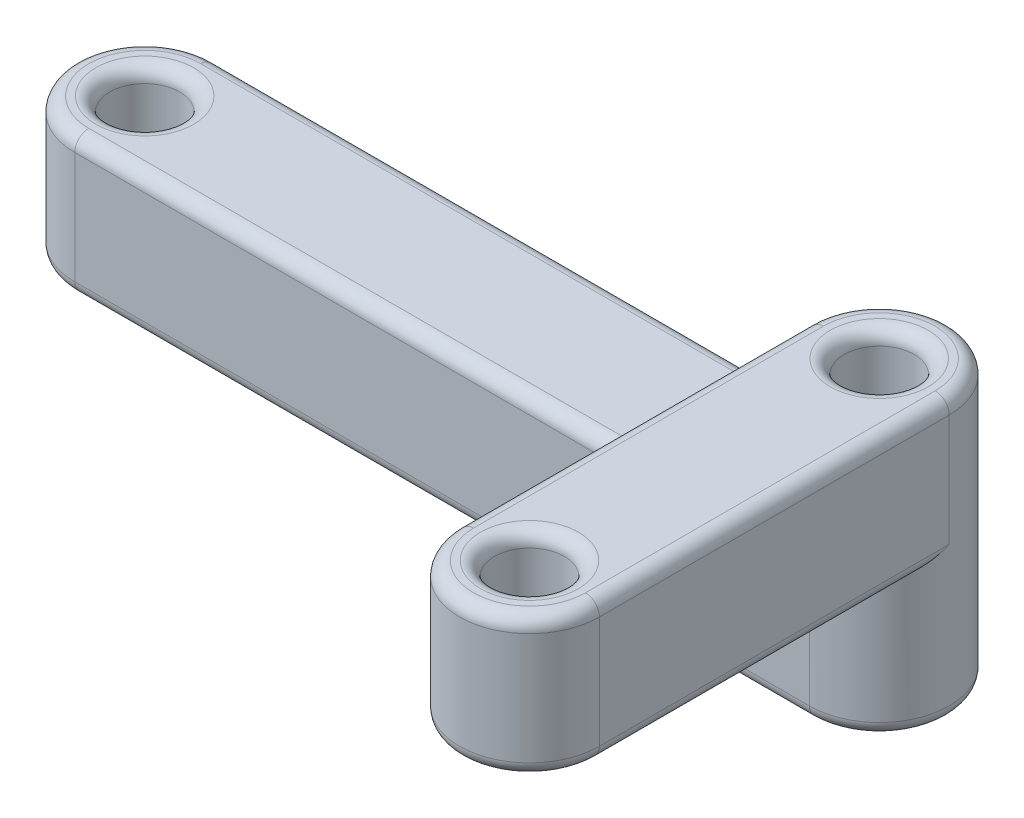
ISO-10303-21;
HEADER;
FILE_DESCRIPTION(('STEP AP214'),'2;1');
FILE_NAME('part.step','',(''),(''),'','','');
FILE_SCHEMA(('AUTOMOTIVE_DESIGN { 1 0 10303 214 1 1 1 1 }'));
ENDSEC;
DATA;
#1=APPLICATION_CONTEXT('core data for automotive mechanical design processes');
#2=APPLICATION_PROTOCOL_DEFINITION('international standard','automotive_design',2000,#1);
#3=PRODUCT_CONTEXT('',#1,'mechanical');
#4=PRODUCT('Part','Part','',(#3));
#5=PRODUCT_RELATED_PRODUCT_CATEGORY('part','',(#4));
#6=PRODUCT_DEFINITION_FORMATION('','',#4);
#7=PRODUCT_DEFINITION_CONTEXT('part definition',#1,'design');
#8=PRODUCT_DEFINITION('design','',#6,#7);
#9=PRODUCT_DEFINITION_SHAPE('','',#8);
#10=(LENGTH_UNIT() NAMED_UNIT(*) SI_UNIT(.MILLI.,.METRE.));
#11=(NAMED_UNIT(*) PLANE_ANGLE_UNIT() SI_UNIT($,.RADIAN.));
#12=(NAMED_UNIT(*) SI_UNIT($,.STERADIAN.) SOLID_ANGLE_UNIT());
#13=UNCERTAINTY_MEASURE_WITH_UNIT(LENGTH_MEASURE(1.E-05),#10,'distance_accuracy_value','');
#14=(GEOMETRIC_REPRESENTATION_CONTEXT(3) GLOBAL_UNCERTAINTY_ASSIGNED_CONTEXT((#13)) GLOBAL_UNIT_ASSIGNED_CONTEXT((#10,
#11,#12)) REPRESENTATION_CONTEXT('',''));
#15=CARTESIAN_POINT('',(0.,0.,0.));
#16=DIRECTION('',(0.,0.,1.));
#17=DIRECTION('',(1.,0.,0.));
#18=AXIS2_PLACEMENT_3D('',#15,#16,#17);
#19=CARTESIAN_POINT('',(0.,10.,0.));
#20=DIRECTION('',(0.,1.,0.));
#21=DIRECTION('',(0.,0.,1.));
#22=AXIS2_PLACEMENT_3D('',#19,#20,#21);
#23=PLANE('',#22);
#24=CARTESIAN_POINT('',(0.,10.,0.));
#25=DIRECTION('',(0.,1.,0.));
#26=DIRECTION('',(0.,0.,1.));
#27=AXIS2_PLACEMENT_3D('',#24,#25,#26);
#28=CIRCLE('',#27,3.5);
#29=CARTESIAN_POINT('',(0.,10.,3.5));
#30=VERTEX_POINT('',#29);
#31=EDGE_CURVE('E182',#30,#30,#28,.F.);
#32=ORIENTED_EDGE('',*,*,#31,.T.);
#33=EDGE_LOOP('',(#32));
#34=FACE_BOUND('',#33,.T.);
#35=CARTESIAN_POINT('',(52.5,10.,0.));
#36=DIRECTION('',(0.,1.,0.));
#37=DIRECTION('',(0.,0.,1.));
#38=AXIS2_PLACEMENT_3D('',#35,#36,#37);
#39=CIRCLE('',#38,5.);
#40=CARTESIAN_POINT('',(49.5,10.,-4.));
#41=VERTEX_POINT('',#40);
#42=CARTESIAN_POINT('',(48.4999976821951,10.,2.99999690959103));
#43=VERTEX_POINT('',#42);
#44=EDGE_CURVE('E56',#41,#43,#39,.T.);
#45=ORIENTED_EDGE('',*,*,#44,.F.);
#46=DIRECTION('',(-1.,0.,0.));
#47=VECTOR('',#46,1.);
#48=CARTESIAN_POINT('',(0.,10.,-4.));
#49=LINE('',#48,#47);
#50=CARTESIAN_POINT('',(0.,10.,-4.));
#51=VERTEX_POINT('',#50);
#52=EDGE_CURVE('E169',#41,#51,#49,.T.);
#53=ORIENTED_EDGE('',*,*,#52,.T.);
#54=CARTESIAN_POINT('',(0.,10.,0.));
#55=DIRECTION('',(0.,1.,0.));
#56=DIRECTION('',(0.,0.,1.));
#57=AXIS2_PLACEMENT_3D('',#54,#55,#56);
#58=CIRCLE('',#57,4.);
#59=CARTESIAN_POINT('',(0.,10.,4.));
#60=VERTEX_POINT('',#59);
#61=EDGE_CURVE('E183',#51,#60,#58,.T.);
#62=ORIENTED_EDGE('',*,*,#61,.T.);
#63=DIRECTION('',(1.,0.,0.));
#64=VECTOR('',#63,1.);
#65=CARTESIAN_POINT('',(47.5,10.,4.));
#66=LINE('',#65,#64);
#67=CARTESIAN_POINT('',(48.5,10.,4.0000029962598));
#68=VERTEX_POINT('',#67);
#69=EDGE_CURVE('E174',#60,#68,#66,.T.);
#70=ORIENTED_EDGE('',*,*,#69,.T.);
#71=DIRECTION('',(0.,0.,1.));
#72=VECTOR('',#71,1.);
#73=CARTESIAN_POINT('',(48.5,10.,3.49999845479596));
#74=LINE('',#73,#72);
#75=EDGE_CURVE('E49',#68,#43,#74,.F.);
#76=ORIENTED_EDGE('',*,*,#75,.T.);
#77=EDGE_LOOP('',(#45,#53,#62,#70,#76));
#78=FACE_BOUND('',#77,.T.);
#79=ADVANCED_FACE('F39',(#34,#78),#23,.T.);
#80=CARTESIAN_POINT('',(0.,0.,0.));
#81=DIRECTION('',(0.,1.,0.));
#82=DIRECTION('',(0.,0.,1.));
#83=AXIS2_PLACEMENT_3D('',#80,#81,#82);
#84=PLANE('',#83);
#85=CARTESIAN_POINT('',(52.5,0.,0.));
#86=DIRECTION('',(0.,1.,0.));
#87=DIRECTION('',(0.,0.,1.));
#88=AXIS2_PLACEMENT_3D('',#85,#86,#87);
#89=CIRCLE('',#88,3.5);
#90=CARTESIAN_POINT('',(52.5,0.,3.5));
#91=VERTEX_POINT('',#90);
#92=EDGE_CURVE('E296',#91,#91,#89,.T.);
#93=ORIENTED_EDGE('',*,*,#92,.T.);
#94=EDGE_LOOP('',(#93));
#95=FACE_BOUND('',#94,.T.);
#96=CARTESIAN_POINT('',(0.,0.,0.));
#97=DIRECTION('',(0.,1.,0.));
#98=DIRECTION('',(0.,0.,1.));
#99=AXIS2_PLACEMENT_3D('',#96,#97,#98);
#100=CIRCLE('',#99,3.5);
#101=CARTESIAN_POINT('',(0.,0.,3.5));
#102=VERTEX_POINT('',#101);
#103=EDGE_CURVE('E292',#102,#102,#100,.T.);
#104=ORIENTED_EDGE('',*,*,#103,.T.);
#105=EDGE_LOOP('',(#104));
#106=FACE_BOUND('',#105,.T.);
#107=CARTESIAN_POINT('',(52.5,0.,0.));
#108=DIRECTION('',(0.,1.,0.));
#109=DIRECTION('',(0.,0.,1.));
#110=AXIS2_PLACEMENT_3D('',#107,#108,#109);
#111=CIRCLE('',#110,4.);
#112=CARTESIAN_POINT('',(52.5,0.,-4.));
#113=VERTEX_POINT('',#112);
#114=CARTESIAN_POINT('',(52.5,0.,4.));
#115=VERTEX_POINT('',#114);
#116=EDGE_CURVE('E285',#113,#115,#111,.F.);
#117=ORIENTED_EDGE('',*,*,#116,.T.);
#118=DIRECTION('',(1.,0.,0.));
#119=VECTOR('',#118,1.);
#120=CARTESIAN_POINT('',(0.,0.,4.));
#121=LINE('',#120,#119);
#122=CARTESIAN_POINT('',(0.,0.,4.));
#123=VERTEX_POINT('',#122);
#124=EDGE_CURVE('E288',#115,#123,#121,.F.);
#125=ORIENTED_EDGE('',*,*,#124,.T.);
#126=CARTESIAN_POINT('',(0.,0.,0.));
#127=DIRECTION('',(0.,1.,0.));
#128=DIRECTION('',(0.,0.,1.));
#129=AXIS2_PLACEMENT_3D('',#126,#127,#128);
#130=CIRCLE('',#129,4.);
#131=CARTESIAN_POINT('',(0.,0.,-4.));
#132=VERTEX_POINT('',#131);
#133=EDGE_CURVE('E279',#123,#132,#130,.F.);
#134=ORIENTED_EDGE('',*,*,#133,.T.);
#135=DIRECTION('',(-1.,0.,0.));
#136=VECTOR('',#135,1.);
#137=CARTESIAN_POINT('',(0.,0.,-4.));
#138=LINE('',#137,#136);
#139=EDGE_CURVE('E282',#132,#113,#138,.F.);
#140=ORIENTED_EDGE('',*,*,#139,.T.);
#141=EDGE_LOOP('',(#117,#125,#134,#140));
#142=FACE_BOUND('',#141,.T.);
#143=ADVANCED_FACE('F420',(#95,#106,#142),#84,.F.);
#144=CARTESIAN_POINT('',(0.,10.,0.));
#145=DIRECTION('',(0.,-1.,0.));
#146=DIRECTION('',(0.,0.,-1.));
#147=AXIS2_PLACEMENT_3D('',#144,#145,#146);
#148=CYLINDRICAL_SURFACE('',#147,5.);
#149=DIRECTION('',(0.,-1.,0.));
#150=VECTOR('',#149,1.);
#151=CARTESIAN_POINT('',(0.,10.,5.));
#152=LINE('',#151,#150);
#153=CARTESIAN_POINT('',(0.,9.,5.));
#154=VERTEX_POINT('',#153);
#155=CARTESIAN_POINT('',(0.,0.999999999999999,5.));
#156=VERTEX_POINT('',#155);
#157=EDGE_CURVE('E175',#154,#156,#152,.T.);
#158=ORIENTED_EDGE('',*,*,#157,.F.);
#159=CARTESIAN_POINT('',(0.,9.,0.));
#160=DIRECTION('',(0.,1.,0.));
#161=DIRECTION('',(0.,0.,1.));
#162=AXIS2_PLACEMENT_3D('',#159,#160,#161);
#163=CIRCLE('',#162,5.);
#164=CARTESIAN_POINT('',(0.,9.,-5.));
#165=VERTEX_POINT('',#164);
#166=EDGE_CURVE('E201',#154,#165,#163,.F.);
#167=ORIENTED_EDGE('',*,*,#166,.T.);
#168=DIRECTION('',(0.,-1.,0.));
#169=VECTOR('',#168,1.);
#170=CARTESIAN_POINT('',(0.,10.,-5.));
#171=LINE('',#170,#169);
#172=CARTESIAN_POINT('',(0.,0.999999999999999,-5.));
#173=VERTEX_POINT('',#172);
#174=EDGE_CURVE('E440',#165,#173,#171,.T.);
#175=ORIENTED_EDGE('',*,*,#174,.T.);
#176=CARTESIAN_POINT('',(0.,0.999999999999999,0.));
#177=DIRECTION('',(0.,1.,0.));
#178=DIRECTION('',(0.,0.,1.));
#179=AXIS2_PLACEMENT_3D('',#176,#177,#178);
#180=CIRCLE('',#179,5.);
#181=EDGE_CURVE('E198',#173,#156,#180,.T.);
#182=ORIENTED_EDGE('',*,*,#181,.T.);
#183=EDGE_LOOP('',(#158,#167,#175,#182));
#184=FACE_BOUND('',#183,.T.);
#185=ADVANCED_FACE('F493',(#184),#148,.T.);
#186=CARTESIAN_POINT('',(0.,10.,5.));
#187=DIRECTION('',(0.,0.,-1.));
#188=DIRECTION('',(-1.,0.,0.));
#189=AXIS2_PLACEMENT_3D('',#186,#187,#188);
#190=PLANE('',#189);
#191=ORIENTED_EDGE('',*,*,#157,.T.);
#192=DIRECTION('',(1.,0.,0.));
#193=VECTOR('',#192,1.);
#194=CARTESIAN_POINT('',(0.,0.999999999999999,5.));
#195=LINE('',#194,#193);
#196=CARTESIAN_POINT('',(52.5,0.999999999999999,5.));
#197=VERTEX_POINT('',#196);
#198=EDGE_CURVE('E165',#156,#197,#195,.T.);
#199=ORIENTED_EDGE('',*,*,#198,.T.);
#200=DIRECTION('',(0.,-1.,0.));
#201=VECTOR('',#200,1.);
#202=CARTESIAN_POINT('',(52.5,10.,5.));
#203=LINE('',#202,#201);
#204=CARTESIAN_POINT('',(52.5,9.,5.));
#205=VERTEX_POINT('',#204);
#206=EDGE_CURVE('E431',#205,#197,#203,.T.);
#207=ORIENTED_EDGE('',*,*,#206,.F.);
#208=DIRECTION('',(1.,0.,0.));
#209=VECTOR('',#208,1.);
#210=CARTESIAN_POINT('',(0.,9.,5.));
#211=LINE('',#210,#209);
#212=EDGE_CURVE('E308',#205,#154,#211,.F.);
#213=ORIENTED_EDGE('',*,*,#212,.T.);
#214=EDGE_LOOP('',(#191,#199,#207,#213));
#215=FACE_BOUND('',#214,.T.);
#216=ADVANCED_FACE('F334',(#215),#190,.F.);
#217=CARTESIAN_POINT('',(52.5,10.,0.));
#218=DIRECTION('',(0.,-1.,0.));
#219=DIRECTION('',(0.,0.,-1.));
#220=AXIS2_PLACEMENT_3D('',#217,#218,#219);
#221=CYLINDRICAL_SURFACE('',#220,5.);
#222=DIRECTION('',(0.,-1.,0.));
#223=VECTOR('',#222,1.);
#224=CARTESIAN_POINT('',(47.5,20.,0.));
#225=LINE('',#224,#223);
#226=CARTESIAN_POINT('',(47.5,19.,0.));
#227=VERTEX_POINT('',#226);
#228=CARTESIAN_POINT('',(47.5,11.,0.));
#229=VERTEX_POINT('',#228);
#230=EDGE_CURVE('E462',#227,#229,#225,.T.);
#231=ORIENTED_EDGE('',*,*,#230,.F.);
#232=CARTESIAN_POINT('',(52.5,19.,0.));
#233=DIRECTION('',(0.,1.,0.));
#234=DIRECTION('',(0.,0.,1.));
#235=AXIS2_PLACEMENT_3D('',#232,#233,#234);
#236=CIRCLE('',#235,5.);
#237=CARTESIAN_POINT('',(57.5,19.,0.));
#238=VERTEX_POINT('',#237);
#239=EDGE_CURVE('E268',#227,#238,#236,.F.);
#240=ORIENTED_EDGE('',*,*,#239,.T.);
#241=DIRECTION('',(0.,-1.,0.));
#242=VECTOR('',#241,1.);
#243=CARTESIAN_POINT('',(57.5,20.,0.));
#244=LINE('',#243,#242);
#245=CARTESIAN_POINT('',(57.5,11.,0.));
#246=VERTEX_POINT('',#245);
#247=EDGE_CURVE('E381',#238,#246,#244,.T.);
#248=ORIENTED_EDGE('',*,*,#247,.T.);
#249=CARTESIAN_POINT('',(56.5,10.,3.));
#250=CARTESIAN_POINT('',(56.5473045609069,10.0000371623371,2.93694469530654));
#251=CARTESIAN_POINT('',(56.5930515988321,10.0033524811115,2.87282528320766));
#252=CARTESIAN_POINT('',(56.6811677355867,10.0155357840315,2.74298227571179));
#253=CARTESIAN_POINT('',(56.7235430910172,10.0243931997809,2.67726196184714));
#254=CARTESIAN_POINT('',(56.8045590614737,10.0465893681849,2.54494770540636));
#255=CARTESIAN_POINT('',(56.843223014705,10.0598973817613,2.47836268732835));
#256=CARTESIAN_POINT('',(56.9171260446218,10.0902730823418,2.34411430702213));
#257=CARTESIAN_POINT('',(56.9523628486697,10.1073432399562,2.27645026340865));
#258=CARTESIAN_POINT('',(57.040738852702,10.1564689465733,2.09692992286534));
#259=CARTESIAN_POINT('',(57.0909944731759,10.1911463028468,1.98436263846201));
#260=CARTESIAN_POINT('',(57.1824784458445,10.2666906947068,1.75765553787566));
#261=CARTESIAN_POINT('',(57.2237029602559,10.3075603492893,1.64351507498279));
#262=CARTESIAN_POINT('',(57.2975084908041,10.3940114614077,1.41369488013739));
#263=CARTESIAN_POINT('',(57.3300552903853,10.4396106144798,1.29801088982785));
#264=CARTESIAN_POINT('',(57.3865178315478,10.5340479617569,1.0659279349572));
#265=CARTESIAN_POINT('',(57.4104363503651,10.5828851077276,0.949529212741659));
#266=CARTESIAN_POINT('',(57.4531791346661,10.691153566795,0.69652380572792));
#267=CARTESIAN_POINT('',(57.4704595596891,10.7509805574236,0.559826112249049));
#268=CARTESIAN_POINT('',(57.4936734801876,10.8719499211339,0.286372958720131));
#269=CARTESIAN_POINT('',(57.4996304485303,10.9330893068729,0.149618207237307));
#270=CARTESIAN_POINT('',(57.4999944415562,10.9961510185399,0.00860658611443853));
#271=CARTESIAN_POINT('',(57.4999999967752,10.9980755215741,0.00430326664155501));
#272=CARTESIAN_POINT('',(57.5,11.,0.));
#273=B_SPLINE_CURVE_WITH_KNOTS('',3,(#249,#250,#251,#252,#253,#254,#255,#256,#257,#258,#259,
#260,#261,#262,#263,#264,#265,#266,#267,#268,#269,#270,#271,#272),.UNSPECIFIED.,.F.,.F.,(4,2,2,
2,2,2,2,2,2,2,2,4),(0.,0.236272200850865,0.472095214354163,0.706321989677946,0.940703043144717,
1.32429275355729,1.70804515619849,2.09328905143225,2.4784088350463,2.92860728181174,
3.37787147131306,3.39201361675778),.UNSPECIFIED.);
#274=CARTESIAN_POINT('',(56.5,10.,3.));
#275=VERTEX_POINT('',#274);
#276=EDGE_CURVE('E164',#246,#275,#273,.F.);
#277=ORIENTED_EDGE('',*,*,#276,.T.);
#278=CARTESIAN_POINT('',(52.5,10.,0.));
#279=DIRECTION('',(0.,1.,0.));
#280=DIRECTION('',(0.,0.,1.));
#281=AXIS2_PLACEMENT_3D('',#278,#279,#280);
#282=CIRCLE('',#281,5.);
#283=CARTESIAN_POINT('',(49.500003090395,10.,4.00000231779438));
#284=VERTEX_POINT('',#283);
#285=EDGE_CURVE('E63',#284,#275,#282,.T.);
#286=ORIENTED_EDGE('',*,*,#285,.F.);
#287=CARTESIAN_POINT('',(49.5000030903941,10.,4.00000231779557));
#288=CARTESIAN_POINT('',(49.5630585639918,9.99996272788554,4.0473069292137));
#289=CARTESIAN_POINT('',(49.627178144695,9.99664729604782,4.09305400780324));
#290=CARTESIAN_POINT('',(49.7570214883626,9.98446376315244,4.18117020788826));
#291=CARTESIAN_POINT('',(49.822741969799,9.97560623048925,4.22354558601357));
#292=CARTESIAN_POINT('',(49.9550565615217,9.95340982711111,4.30456158689411));
#293=CARTESIAN_POINT('',(50.0216417473626,9.94010169532688,4.34322554784478));
#294=CARTESIAN_POINT('',(50.1558904622435,9.90972575797051,4.4171285781539));
#295=CARTESIAN_POINT('',(50.2235546726675,9.89265548178963,4.45236537486656));
#296=CARTESIAN_POINT('',(50.4030754431162,9.8435294660715,4.54074133686772));
#297=CARTESIAN_POINT('',(50.515642989588,9.80885192064983,4.59099691159405));
#298=CARTESIAN_POINT('',(50.7423506113859,9.73330715742923,4.68248075978109));
#299=CARTESIAN_POINT('',(50.8564913334213,9.69243732063438,4.72370519544018));
#300=CARTESIAN_POINT('',(51.0863120402139,9.60598585454873,4.7975105354013));
#301=CARTESIAN_POINT('',(51.2019962832758,9.56038652992614,4.83005722334842));
#302=CARTESIAN_POINT('',(51.4340797400968,9.4659488520361,4.88651951097145));
#303=CARTESIAN_POINT('',(51.5504787115088,9.41711154701025,4.91043788792276));
#304=CARTESIAN_POINT('',(51.8034830148737,9.3088434609588,4.95318005443348));
#305=CARTESIAN_POINT('',(51.9401793465249,9.2490170406606,4.97046013632466));
#306=CARTESIAN_POINT('',(52.213629772101,9.12804885797665,4.99367359904575));
#307=CARTESIAN_POINT('',(52.3503831574857,9.06691008281707,4.9996304520507));
#308=CARTESIAN_POINT('',(52.4913934138853,9.00384898146071,4.9999944415563));
#309=CARTESIAN_POINT('',(52.4956967333581,9.00192447842627,4.99999999677532));
#310=CARTESIAN_POINT('',(52.5,9.,5.));
#311=B_SPLINE_CURVE_WITH_KNOTS('',3,(#287,#288,#289,#290,#291,#292,#293,#294,#295,#296,#297,
#298,#299,#300,#301,#302,#303,#304,#305,#306,#307,#308,#309,#310),.UNSPECIFIED.,.F.,.F.,(4,2,2,
2,2,2,2,2,2,2,2,4),(0.,0.236272696950567,0.472096206008266,0.706323481753092,0.940705035857717,
1.32429553611635,1.70804872912376,2.09329340374744,2.47841396517604,2.92860790899919,
3.37786761366824,3.39200975911296),.UNSPECIFIED.);
#312=EDGE_CURVE('E340',#284,#205,#311,.T.);
#313=ORIENTED_EDGE('',*,*,#312,.T.);
#314=ORIENTED_EDGE('',*,*,#206,.T.);
#315=CARTESIAN_POINT('',(52.5,0.999999999999999,0.));
#316=DIRECTION('',(0.,1.,0.));
#317=DIRECTION('',(0.,0.,1.));
#318=AXIS2_PLACEMENT_3D('',#315,#316,#317);
#319=CIRCLE('',#318,5.);
#320=CARTESIAN_POINT('',(52.5,0.999999999999999,-5.));
#321=VERTEX_POINT('',#320);
#322=EDGE_CURVE('E265',#197,#321,#319,.T.);
#323=ORIENTED_EDGE('',*,*,#322,.T.);
#324=DIRECTION('',(0.,-1.,0.));
#325=VECTOR('',#324,1.);
#326=CARTESIAN_POINT('',(52.5,10.,-5.));
#327=LINE('',#326,#325);
#328=CARTESIAN_POINT('',(52.5,9.,-5.));
#329=VERTEX_POINT('',#328);
#330=EDGE_CURVE('E159',#329,#321,#327,.T.);
#331=ORIENTED_EDGE('',*,*,#330,.F.);
#332=CARTESIAN_POINT('',(49.5,10.,-4.));
#333=CARTESIAN_POINT('',(49.5630553046935,9.99996283766288,-4.04730456090694));
#334=CARTESIAN_POINT('',(49.6271747167924,9.99664751888849,-4.09305159883218));
#335=CARTESIAN_POINT('',(49.7570177242884,9.9844642159685,-4.18116773558682));
#336=CARTESIAN_POINT('',(49.8227380381531,9.97560680021902,-4.22354309101737));
#337=CARTESIAN_POINT('',(49.9550522945939,9.95341063181508,-4.30455906147386));
#338=CARTESIAN_POINT('',(50.0216373126719,9.94010261823865,-4.34322301470518));
#339=CARTESIAN_POINT('',(50.155885692978,9.90972691765818,-4.4171260446219));
#340=CARTESIAN_POINT('',(50.2235497365914,9.89265676004379,-4.45236284866976));
#341=CARTESIAN_POINT('',(50.4030700771347,9.84353105342674,-4.54073885270201));
#342=CARTESIAN_POINT('',(50.5156373615379,9.80885369715323,-4.59099447317587));
#343=CARTESIAN_POINT('',(50.7423444621242,9.73330930529322,-4.68247844584442));
#344=CARTESIAN_POINT('',(50.8564849250171,9.69243965071081,-4.72370296025583));
#345=CARTESIAN_POINT('',(51.0863051198625,9.6059885385923,-4.79750849080412));
#346=CARTESIAN_POINT('',(51.201989110172,9.56038938552016,-4.83005529038532));
#347=CARTESIAN_POINT('',(51.4340720650428,9.46595203824321,-4.88651783154781));
#348=CARTESIAN_POINT('',(51.5504707872585,9.41711489227277,-4.91043635036513));
#349=CARTESIAN_POINT('',(51.8034761942719,9.30884643320454,-4.9531791346661));
#350=CARTESIAN_POINT('',(51.9401738877502,9.24901944257476,-4.97045955968912));
#351=CARTESIAN_POINT('',(52.2136270412806,9.12805007886777,-4.99367348018758));
#352=CARTESIAN_POINT('',(52.3503817927655,9.06691069313336,-4.99963044853027));
#353=CARTESIAN_POINT('',(52.4913934138857,9.00384898146051,-4.99999444155623));
#354=CARTESIAN_POINT('',(52.4956967333585,9.00192447842606,-4.99999999677524));
#355=CARTESIAN_POINT('',(52.5,9.,-5.));
#356=B_SPLINE_CURVE_WITH_KNOTS('',3,(#332,#333,#334,#335,#336,#337,#338,#339,#340,#341,#342,
#343,#344,#345,#346,#347,#348,#349,#350,#351,#352,#353,#354,#355),.UNSPECIFIED.,.F.,.F.,(4,2,2,
2,2,2,2,2,2,2,2,4),(0.,0.236272200851054,0.472095214354542,0.706321989678148,0.940703043144736,
1.32429275355718,1.70804515619829,2.09328905143219,2.47840883504634,2.92860728181177,
3.37787147131305,3.39201361675777),.UNSPECIFIED.);
#357=EDGE_CURVE('E155',#329,#41,#356,.F.);
#358=ORIENTED_EDGE('',*,*,#357,.T.);
#359=ORIENTED_EDGE('',*,*,#44,.T.);
#360=CARTESIAN_POINT('',(48.4999976821939,10.,2.99999690959192));
#361=CARTESIAN_POINT('',(48.4526930707756,10.000037272115,2.93694143599348));
#362=CARTESIAN_POINT('',(48.4069459921859,10.0033527039532,2.87282185528957));
#363=CARTESIAN_POINT('',(48.3188297921007,10.0155362368496,2.74297851162058));
#364=CARTESIAN_POINT('',(48.2764544139753,10.0243937695133,2.67725803018338));
#365=CARTESIAN_POINT('',(48.1954384130946,10.0465901728925,2.54494343845922));
#366=CARTESIAN_POINT('',(48.1567744521439,10.0598983046773,2.47835825261752));
#367=CARTESIAN_POINT('',(48.0828714218347,10.0902742420347,2.34410953773508));
#368=CARTESIAN_POINT('',(48.047634625122,10.1073445182161,2.27644532731026));
#369=CARTESIAN_POINT('',(47.959258663121,10.1564705339357,2.09692455685947));
#370=CARTESIAN_POINT('',(47.9090030883949,10.1911480793582,1.98435701038647));
#371=CARTESIAN_POINT('',(47.8175192402084,10.2666928425805,1.75764938858617));
#372=CARTESIAN_POINT('',(47.7762948045497,10.3075626793762,1.64350866654961));
#373=CARTESIAN_POINT('',(47.7024894645894,10.3940141454634,1.41368795975462));
#374=CARTESIAN_POINT('',(47.6699427766428,10.4396134700867,1.2980037166916));
#375=CARTESIAN_POINT('',(47.6134804890209,10.5340511479784,1.06592025986847));
#376=CARTESIAN_POINT('',(47.5895621120703,10.5828884530052,0.949521288455527));
#377=CARTESIAN_POINT('',(47.5468199455624,10.6911565390543,0.696516985095275));
#378=CARTESIAN_POINT('',(47.5295398636727,10.7509829593489,0.559820653449804));
#379=CARTESIAN_POINT('',(47.5063264009537,10.8719511420303,0.286370227887296));
#380=CARTESIAN_POINT('',(47.5003695479493,10.933089917191,0.149616842510525));
#381=CARTESIAN_POINT('',(47.5000055584437,10.9961510185396,0.0086065861148645));
#382=CARTESIAN_POINT('',(47.5000000032247,10.9980755215739,0.00430326664198846));
#383=CARTESIAN_POINT('',(47.5,11.,0.));
#384=B_SPLINE_CURVE_WITH_KNOTS('',3,(#360,#361,#362,#363,#364,#365,#366,#367,#368,#369,#370,
#371,#372,#373,#374,#375,#376,#377,#378,#379,#380,#381,#382,#383),.UNSPECIFIED.,.F.,.F.,(4,2,2,
2,2,2,2,2,2,2,2,4),(0.,0.236272696952657,0.472096206012431,0.706323481759676,0.940705035866721,
1.32429553612904,1.70804872914011,2.0932934037672,2.47841396519923,2.928607909002,
3.37786761365079,3.39200975909551),.UNSPECIFIED.);
#385=EDGE_CURVE('E11',#43,#229,#384,.T.);
#386=ORIENTED_EDGE('',*,*,#385,.T.);
#387=EDGE_LOOP('',(#231,#240,#248,#277,#286,#313,#314,#323,#331,#358,#359,#386));
#388=FACE_BOUND('',#387,.T.);
#389=ADVANCED_FACE('F157',(#388),#221,.T.);
#390=CARTESIAN_POINT('',(0.,10.,-5.));
#391=DIRECTION('',(0.,0.,1.));
#392=DIRECTION('',(1.,0.,0.));
#393=AXIS2_PLACEMENT_3D('',#390,#391,#392);
#394=PLANE('',#393);
#395=ORIENTED_EDGE('',*,*,#174,.F.);
#396=DIRECTION('',(-1.,0.,0.));
#397=VECTOR('',#396,1.);
#398=CARTESIAN_POINT('',(52.5,9.,-5.));
#399=LINE('',#398,#397);
#400=EDGE_CURVE('E195',#165,#329,#399,.F.);
#401=ORIENTED_EDGE('',*,*,#400,.T.);
#402=ORIENTED_EDGE('',*,*,#330,.T.);
#403=DIRECTION('',(-1.,0.,0.));
#404=VECTOR('',#403,1.);
#405=CARTESIAN_POINT('',(0.,0.999999999999999,-5.));
#406=LINE('',#405,#404);
#407=EDGE_CURVE('E188',#321,#173,#406,.T.);
#408=ORIENTED_EDGE('',*,*,#407,.T.);
#409=EDGE_LOOP('',(#395,#401,#402,#408));
#410=FACE_BOUND('',#409,.T.);
#411=ADVANCED_FACE('F333',(#410),#394,.F.);
#412=CARTESIAN_POINT('',(0.,10.,0.));
#413=DIRECTION('',(0.,-1.,0.));
#414=DIRECTION('',(0.,0.,-1.));
#415=AXIS2_PLACEMENT_3D('',#412,#413,#414);
#416=CYLINDRICAL_SURFACE('',#415,2.5);
#417=CARTESIAN_POINT('',(0.,0.999999999999999,0.));
#418=DIRECTION('',(0.,1.,0.));
#419=DIRECTION('',(0.,0.,1.));
#420=AXIS2_PLACEMENT_3D('',#417,#418,#419);
#421=CIRCLE('',#420,2.5);
#422=CARTESIAN_POINT('',(0.,0.999999999999999,2.5));
#423=VERTEX_POINT('',#422);
#424=EDGE_CURVE('E304',#423,#423,#421,.F.);
#425=ORIENTED_EDGE('',*,*,#424,.T.);
#426=EDGE_LOOP('',(#425));
#427=FACE_BOUND('',#426,.T.);
#428=CARTESIAN_POINT('',(0.,9.,0.));
#429=DIRECTION('',(0.,1.,0.));
#430=DIRECTION('',(0.,0.,1.));
#431=AXIS2_PLACEMENT_3D('',#428,#429,#430);
#432=CIRCLE('',#431,2.5);
#433=CARTESIAN_POINT('',(0.,9.,2.5));
#434=VERTEX_POINT('',#433);
#435=EDGE_CURVE('E300',#434,#434,#432,.T.);
#436=ORIENTED_EDGE('',*,*,#435,.T.);
#437=EDGE_LOOP('',(#436));
#438=FACE_BOUND('',#437,.T.);
#439=ADVANCED_FACE('F510',(#427,#438),#416,.F.);
#440=CARTESIAN_POINT('',(52.5,10.,0.));
#441=DIRECTION('',(0.,-1.,0.));
#442=DIRECTION('',(0.,0.,-1.));
#443=AXIS2_PLACEMENT_3D('',#440,#441,#442);
#444=CYLINDRICAL_SURFACE('',#443,2.5);
#445=CARTESIAN_POINT('',(52.5,19.,0.));
#446=DIRECTION('',(0.,1.,0.));
#447=DIRECTION('',(0.,0.,1.));
#448=AXIS2_PLACEMENT_3D('',#445,#446,#447);
#449=CIRCLE('',#448,2.5);
#450=CARTESIAN_POINT('',(52.5,19.,2.5));
#451=VERTEX_POINT('',#450);
#452=EDGE_CURVE('E275',#451,#451,#449,.T.);
#453=ORIENTED_EDGE('',*,*,#452,.T.);
#454=EDGE_LOOP('',(#453));
#455=FACE_BOUND('',#454,.T.);
#456=CARTESIAN_POINT('',(52.5,0.999999999999999,0.));
#457=DIRECTION('',(0.,1.,0.));
#458=DIRECTION('',(0.,0.,1.));
#459=AXIS2_PLACEMENT_3D('',#456,#457,#458);
#460=CIRCLE('',#459,2.5);
#461=CARTESIAN_POINT('',(52.5,0.999999999999999,2.5));
#462=VERTEX_POINT('',#461);
#463=EDGE_CURVE('E271',#462,#462,#460,.F.);
#464=ORIENTED_EDGE('',*,*,#463,.T.);
#465=EDGE_LOOP('',(#464));
#466=FACE_BOUND('',#465,.T.);
#467=ADVANCED_FACE('F513',(#455,#466),#444,.F.);
#468=CARTESIAN_POINT('',(52.5,10.,0.));
#469=DIRECTION('',(0.,1.,0.));
#470=DIRECTION('',(0.,0.,1.));
#471=AXIS2_PLACEMENT_3D('',#468,#469,#470);
#472=PLANE('',#471);
#473=CARTESIAN_POINT('',(52.5,10.,25.));
#474=DIRECTION('',(0.,1.,0.));
#475=DIRECTION('',(0.,0.,1.));
#476=AXIS2_PLACEMENT_3D('',#473,#474,#475);
#477=CIRCLE('',#476,3.5);
#478=CARTESIAN_POINT('',(52.5,10.,28.5));
#479=VERTEX_POINT('',#478);
#480=EDGE_CURVE('E211',#479,#479,#477,.T.);
#481=ORIENTED_EDGE('',*,*,#480,.T.);
#482=EDGE_LOOP('',(#481));
#483=FACE_BOUND('',#482,.T.);
#484=ORIENTED_EDGE('',*,*,#285,.T.);
#485=DIRECTION('',(0.,0.,-1.));
#486=VECTOR('',#485,1.);
#487=CARTESIAN_POINT('',(56.5,10.,0.));
#488=LINE('',#487,#486);
#489=CARTESIAN_POINT('',(56.5,10.,25.));
#490=VERTEX_POINT('',#489);
#491=EDGE_CURVE('E221',#275,#490,#488,.F.);
#492=ORIENTED_EDGE('',*,*,#491,.T.);
#493=CARTESIAN_POINT('',(52.5,10.,25.));
#494=DIRECTION('',(0.,1.,0.));
#495=DIRECTION('',(0.,0.,1.));
#496=AXIS2_PLACEMENT_3D('',#493,#494,#495);
#497=CIRCLE('',#496,3.99999999999999);
#498=CARTESIAN_POINT('',(48.5,10.,25.));
#499=VERTEX_POINT('',#498);
#500=EDGE_CURVE('E218',#490,#499,#497,.F.);
#501=ORIENTED_EDGE('',*,*,#500,.T.);
#502=DIRECTION('',(0.,0.,1.));
#503=VECTOR('',#502,1.);
#504=CARTESIAN_POINT('',(48.5,10.,0.));
#505=LINE('',#504,#503);
#506=EDGE_CURVE('E215',#499,#68,#505,.F.);
#507=ORIENTED_EDGE('',*,*,#506,.T.);
#508=DIRECTION('',(-1.,0.,0.));
#509=VECTOR('',#508,1.);
#510=CARTESIAN_POINT('',(49.0000015451971,10.,4.));
#511=LINE('',#510,#509);
#512=EDGE_CURVE('E348',#68,#284,#511,.F.);
#513=ORIENTED_EDGE('',*,*,#512,.T.);
#514=EDGE_LOOP('',(#484,#492,#501,#507,#513));
#515=FACE_BOUND('',#514,.T.);
#516=ADVANCED_FACE('F459',(#483,#515),#472,.F.);
#517=CARTESIAN_POINT('',(52.5,20.,0.));
#518=DIRECTION('',(0.,1.,0.));
#519=DIRECTION('',(0.,0.,1.));
#520=AXIS2_PLACEMENT_3D('',#517,#518,#519);
#521=PLANE('',#520);
#522=CARTESIAN_POINT('',(52.5,20.,25.));
#523=DIRECTION('',(0.,1.,0.));
#524=DIRECTION('',(0.,0.,1.));
#525=AXIS2_PLACEMENT_3D('',#522,#523,#524);
#526=CIRCLE('',#525,3.5);
#527=CARTESIAN_POINT('',(52.5,20.,28.5));
#528=VERTEX_POINT('',#527);
#529=EDGE_CURVE('E255',#528,#528,#526,.F.);
#530=ORIENTED_EDGE('',*,*,#529,.T.);
#531=EDGE_LOOP('',(#530));
#532=FACE_BOUND('',#531,.T.);
#533=CARTESIAN_POINT('',(52.5,20.,25.));
#534=DIRECTION('',(0.,1.,0.));
#535=DIRECTION('',(0.,0.,1.));
#536=AXIS2_PLACEMENT_3D('',#533,#534,#535);
#537=CIRCLE('',#536,3.99999999999999);
#538=CARTESIAN_POINT('',(48.5,20.,25.));
#539=VERTEX_POINT('',#538);
#540=CARTESIAN_POINT('',(56.5,20.,25.));
#541=VERTEX_POINT('',#540);
#542=EDGE_CURVE('E248',#539,#541,#537,.T.);
#543=ORIENTED_EDGE('',*,*,#542,.T.);
#544=DIRECTION('',(0.,0.,-1.));
#545=VECTOR('',#544,1.);
#546=CARTESIAN_POINT('',(56.5,20.,0.));
#547=LINE('',#546,#545);
#548=CARTESIAN_POINT('',(56.5,20.,0.));
#549=VERTEX_POINT('',#548);
#550=EDGE_CURVE('E251',#541,#549,#547,.T.);
#551=ORIENTED_EDGE('',*,*,#550,.T.);
#552=CARTESIAN_POINT('',(52.5,20.,0.));
#553=DIRECTION('',(0.,1.,0.));
#554=DIRECTION('',(0.,0.,1.));
#555=AXIS2_PLACEMENT_3D('',#552,#553,#554);
#556=CIRCLE('',#555,4.);
#557=CARTESIAN_POINT('',(48.5,20.,0.));
#558=VERTEX_POINT('',#557);
#559=EDGE_CURVE('E242',#549,#558,#556,.T.);
#560=ORIENTED_EDGE('',*,*,#559,.T.);
#561=DIRECTION('',(0.,0.,1.));
#562=VECTOR('',#561,1.);
#563=CARTESIAN_POINT('',(48.5,20.,25.));
#564=LINE('',#563,#562);
#565=EDGE_CURVE('E245',#558,#539,#564,.T.);
#566=ORIENTED_EDGE('',*,*,#565,.T.);
#567=EDGE_LOOP('',(#543,#551,#560,#566));
#568=FACE_BOUND('',#567,.T.);
#569=CARTESIAN_POINT('',(52.5,20.,0.));
#570=DIRECTION('',(0.,1.,0.));
#571=DIRECTION('',(0.,0.,1.));
#572=AXIS2_PLACEMENT_3D('',#569,#570,#571);
#573=CIRCLE('',#572,3.5);
#574=CARTESIAN_POINT('',(52.5,20.,3.5));
#575=VERTEX_POINT('',#574);
#576=EDGE_CURVE('E238',#575,#575,#573,.F.);
#577=ORIENTED_EDGE('',*,*,#576,.T.);
#578=EDGE_LOOP('',(#577));
#579=FACE_BOUND('',#578,.T.);
#580=ADVANCED_FACE('F520',(#532,#568,#579),#521,.T.);
#581=CARTESIAN_POINT('',(47.5,20.,0.));
#582=DIRECTION('',(1.,0.,0.));
#583=DIRECTION('',(0.,0.,-1.));
#584=AXIS2_PLACEMENT_3D('',#581,#582,#583);
#585=PLANE('',#584);
#586=DIRECTION('',(0.,-1.,0.));
#587=VECTOR('',#586,1.);
#588=CARTESIAN_POINT('',(47.5,20.,25.));
#589=LINE('',#588,#587);
#590=CARTESIAN_POINT('',(47.5,19.,25.));
#591=VERTEX_POINT('',#590);
#592=CARTESIAN_POINT('',(47.5,11.,25.));
#593=VERTEX_POINT('',#592);
#594=EDGE_CURVE('E474',#591,#593,#589,.T.);
#595=ORIENTED_EDGE('',*,*,#594,.F.);
#596=DIRECTION('',(0.,0.,1.));
#597=VECTOR('',#596,1.);
#598=CARTESIAN_POINT('',(47.5,19.,0.));
#599=LINE('',#598,#597);
#600=EDGE_CURVE('E262',#591,#227,#599,.F.);
#601=ORIENTED_EDGE('',*,*,#600,.T.);
#602=ORIENTED_EDGE('',*,*,#230,.T.);
#603=DIRECTION('',(0.,0.,1.));
#604=VECTOR('',#603,1.);
#605=CARTESIAN_POINT('',(47.5,11.,0.));
#606=LINE('',#605,#604);
#607=EDGE_CURVE('E259',#229,#593,#606,.T.);
#608=ORIENTED_EDGE('',*,*,#607,.T.);
#609=EDGE_LOOP('',(#595,#601,#602,#608));
#610=FACE_BOUND('',#609,.T.);
#611=ADVANCED_FACE('F473',(#610),#585,.F.);
#612=CARTESIAN_POINT('',(52.5,20.,25.));
#613=DIRECTION('',(0.,-1.,0.));
#614=DIRECTION('',(0.,0.,-1.));
#615=AXIS2_PLACEMENT_3D('',#612,#613,#614);
#616=CYLINDRICAL_SURFACE('',#615,4.99999999999999);
#617=ORIENTED_EDGE('',*,*,#594,.T.);
#618=CARTESIAN_POINT('',(52.5,11.,25.));
#619=DIRECTION('',(0.,1.,0.));
#620=DIRECTION('',(0.,0.,1.));
#621=AXIS2_PLACEMENT_3D('',#618,#619,#620);
#622=CIRCLE('',#621,4.99999999999999);
#623=CARTESIAN_POINT('',(57.5,11.,25.));
#624=VERTEX_POINT('',#623);
#625=EDGE_CURVE('E227',#593,#624,#622,.T.);
#626=ORIENTED_EDGE('',*,*,#625,.T.);
#627=DIRECTION('',(0.,-1.,0.));
#628=VECTOR('',#627,1.);
#629=CARTESIAN_POINT('',(57.5,20.,25.));
#630=LINE('',#629,#628);
#631=CARTESIAN_POINT('',(57.5,19.,25.));
#632=VERTEX_POINT('',#631);
#633=EDGE_CURVE('E482',#632,#624,#630,.T.);
#634=ORIENTED_EDGE('',*,*,#633,.F.);
#635=CARTESIAN_POINT('',(52.5,19.,25.));
#636=DIRECTION('',(0.,1.,0.));
#637=DIRECTION('',(0.,0.,1.));
#638=AXIS2_PLACEMENT_3D('',#635,#636,#637);
#639=CIRCLE('',#638,4.99999999999999);
#640=EDGE_CURVE('E224',#632,#591,#639,.F.);
#641=ORIENTED_EDGE('',*,*,#640,.T.);
#642=EDGE_LOOP('',(#617,#626,#634,#641));
#643=FACE_BOUND('',#642,.T.);
#644=ADVANCED_FACE('F477',(#643),#616,.T.);
#645=CARTESIAN_POINT('',(57.5,20.,0.));
#646=DIRECTION('',(-1.,0.,0.));
#647=DIRECTION('',(0.,0.,1.));
#648=AXIS2_PLACEMENT_3D('',#645,#646,#647);
#649=PLANE('',#648);
#650=ORIENTED_EDGE('',*,*,#633,.T.);
#651=DIRECTION('',(0.,0.,-1.));
#652=VECTOR('',#651,1.);
#653=CARTESIAN_POINT('',(57.5,11.,0.));
#654=LINE('',#653,#652);
#655=EDGE_CURVE('E208',#624,#246,#654,.T.);
#656=ORIENTED_EDGE('',*,*,#655,.T.);
#657=ORIENTED_EDGE('',*,*,#247,.F.);
#658=DIRECTION('',(0.,0.,-1.));
#659=VECTOR('',#658,1.);
#660=CARTESIAN_POINT('',(57.5,19.,25.));
#661=LINE('',#660,#659);
#662=EDGE_CURVE('E204',#238,#632,#661,.F.);
#663=ORIENTED_EDGE('',*,*,#662,.T.);
#664=EDGE_LOOP('',(#650,#656,#657,#663));
#665=FACE_BOUND('',#664,.T.);
#666=ADVANCED_FACE('F523',(#665),#649,.F.);
#667=CARTESIAN_POINT('',(52.5,20.,25.));
#668=DIRECTION('',(0.,-1.,0.));
#669=DIRECTION('',(0.,0.,-1.));
#670=AXIS2_PLACEMENT_3D('',#667,#668,#669);
#671=CYLINDRICAL_SURFACE('',#670,2.5);
#672=CARTESIAN_POINT('',(52.5,19.,25.));
#673=DIRECTION('',(0.,1.,0.));
#674=DIRECTION('',(0.,0.,1.));
#675=AXIS2_PLACEMENT_3D('',#672,#673,#674);
#676=CIRCLE('',#675,2.5);
#677=CARTESIAN_POINT('',(52.5,19.,27.5));
#678=VERTEX_POINT('',#677);
#679=EDGE_CURVE('E234',#678,#678,#676,.T.);
#680=ORIENTED_EDGE('',*,*,#679,.T.);
#681=EDGE_LOOP('',(#680));
#682=FACE_BOUND('',#681,.T.);
#683=CARTESIAN_POINT('',(52.5,11.,25.));
#684=DIRECTION('',(0.,1.,0.));
#685=DIRECTION('',(0.,0.,1.));
#686=AXIS2_PLACEMENT_3D('',#683,#684,#685);
#687=CIRCLE('',#686,2.5);
#688=CARTESIAN_POINT('',(52.5,11.,27.5));
#689=VERTEX_POINT('',#688);
#690=EDGE_CURVE('E230',#689,#689,#687,.F.);
#691=ORIENTED_EDGE('',*,*,#690,.T.);
#692=EDGE_LOOP('',(#691));
#693=FACE_BOUND('',#692,.T.);
#694=ADVANCED_FACE('F526',(#682,#693),#671,.F.);
#695=CARTESIAN_POINT('',(56.5,11.,0.));
#696=DIRECTION('',(0.,0.,-1.));
#697=DIRECTION('',(-1.,0.,0.));
#698=AXIS2_PLACEMENT_3D('',#695,#696,#697);
#699=CYLINDRICAL_SURFACE('',#698,1.);
#700=ORIENTED_EDGE('',*,*,#276,.F.);
#701=ORIENTED_EDGE('',*,*,#655,.F.);
#702=CARTESIAN_POINT('',(56.5,11.,25.));
#703=DIRECTION('',(0.,0.,1.));
#704=DIRECTION('',(1.,0.,0.));
#705=AXIS2_PLACEMENT_3D('',#702,#703,#704);
#706=CIRCLE('',#705,1.);
#707=EDGE_CURVE('E377',#490,#624,#706,.T.);
#708=ORIENTED_EDGE('',*,*,#707,.F.);
#709=ORIENTED_EDGE('',*,*,#491,.F.);
#710=EDGE_LOOP('',(#700,#701,#708,#709));
#711=FACE_BOUND('',#710,.T.);
#712=ADVANCED_FACE('F464',(#711),#699,.T.);
#713=CARTESIAN_POINT('',(52.5,11.,25.));
#714=DIRECTION('',(0.,1.,0.));
#715=DIRECTION('',(0.,0.,1.));
#716=AXIS2_PLACEMENT_3D('',#713,#714,#715);
#717=TOROIDAL_SURFACE('',#716,3.99999999999999,1.);
#718=ORIENTED_EDGE('',*,*,#707,.T.);
#719=ORIENTED_EDGE('',*,*,#625,.F.);
#720=CARTESIAN_POINT('',(48.5,11.,25.));
#721=DIRECTION('',(0.,0.,-1.));
#722=DIRECTION('',(-1.,0.,0.));
#723=AXIS2_PLACEMENT_3D('',#720,#721,#722);
#724=CIRCLE('',#723,1.);
#725=EDGE_CURVE('E373',#499,#593,#724,.T.);
#726=ORIENTED_EDGE('',*,*,#725,.F.);
#727=ORIENTED_EDGE('',*,*,#500,.F.);
#728=EDGE_LOOP('',(#718,#719,#726,#727));
#729=FACE_BOUND('',#728,.T.);
#730=ADVANCED_FACE('F359',(#729),#717,.T.);
#731=CARTESIAN_POINT('',(48.5,11.,0.));
#732=DIRECTION('',(0.,0.,1.));
#733=DIRECTION('',(1.,0.,0.));
#734=AXIS2_PLACEMENT_3D('',#731,#732,#733);
#735=CYLINDRICAL_SURFACE('',#734,1.);
#736=ORIENTED_EDGE('',*,*,#385,.F.);
#737=ORIENTED_EDGE('',*,*,#75,.F.);
#738=ORIENTED_EDGE('',*,*,#506,.F.);
#739=ORIENTED_EDGE('',*,*,#725,.T.);
#740=ORIENTED_EDGE('',*,*,#607,.F.);
#741=EDGE_LOOP('',(#736,#737,#738,#739,#740));
#742=FACE_BOUND('',#741,.T.);
#743=ADVANCED_FACE('F354',(#742),#735,.T.);
#744=CARTESIAN_POINT('',(0.,9.,4.));
#745=DIRECTION('',(-1.,0.,0.));
#746=DIRECTION('',(0.,0.,1.));
#747=AXIS2_PLACEMENT_3D('',#744,#745,#746);
#748=CYLINDRICAL_SURFACE('',#747,1.);
#749=ORIENTED_EDGE('',*,*,#512,.F.);
#750=ORIENTED_EDGE('',*,*,#69,.F.);
#751=CARTESIAN_POINT('',(0.,9.,4.));
#752=DIRECTION('',(-1.,0.,0.));
#753=DIRECTION('',(0.,0.,1.));
#754=AXIS2_PLACEMENT_3D('',#751,#752,#753);
#755=CIRCLE('',#754,1.);
#756=EDGE_CURVE('E368',#154,#60,#755,.T.);
#757=ORIENTED_EDGE('',*,*,#756,.F.);
#758=ORIENTED_EDGE('',*,*,#212,.F.);
#759=ORIENTED_EDGE('',*,*,#312,.F.);
#760=EDGE_LOOP('',(#749,#750,#757,#758,#759));
#761=FACE_BOUND('',#760,.T.);
#762=ADVANCED_FACE('F349',(#761),#748,.T.);
#763=CARTESIAN_POINT('',(0.,9.,0.));
#764=DIRECTION('',(0.,1.,0.));
#765=DIRECTION('',(0.,0.,1.));
#766=AXIS2_PLACEMENT_3D('',#763,#764,#765);
#767=TOROIDAL_SURFACE('',#766,4.,1.);
#768=ORIENTED_EDGE('',*,*,#756,.T.);
#769=ORIENTED_EDGE('',*,*,#61,.F.);
#770=CARTESIAN_POINT('',(0.,9.,-4.));
#771=DIRECTION('',(1.,0.,0.));
#772=DIRECTION('',(0.,0.,-1.));
#773=AXIS2_PLACEMENT_3D('',#770,#771,#772);
#774=CIRCLE('',#773,1.);
#775=EDGE_CURVE('E179',#165,#51,#774,.T.);
#776=ORIENTED_EDGE('',*,*,#775,.F.);
#777=ORIENTED_EDGE('',*,*,#166,.F.);
#778=EDGE_LOOP('',(#768,#769,#776,#777));
#779=FACE_BOUND('',#778,.T.);
#780=ADVANCED_FACE('F353',(#779),#767,.T.);
#781=CARTESIAN_POINT('',(0.,9.,-4.));
#782=DIRECTION('',(1.,0.,0.));
#783=DIRECTION('',(0.,0.,-1.));
#784=AXIS2_PLACEMENT_3D('',#781,#782,#783);
#785=CYLINDRICAL_SURFACE('',#784,1.);
#786=ORIENTED_EDGE('',*,*,#357,.F.);
#787=ORIENTED_EDGE('',*,*,#400,.F.);
#788=ORIENTED_EDGE('',*,*,#775,.T.);
#789=ORIENTED_EDGE('',*,*,#52,.F.);
#790=EDGE_LOOP('',(#786,#787,#788,#789));
#791=FACE_BOUND('',#790,.T.);
#792=ADVANCED_FACE('F177',(#791),#785,.T.);
#793=CARTESIAN_POINT('',(52.5,19.,25.));
#794=DIRECTION('',(0.,1.,0.));
#795=DIRECTION('',(0.,0.,1.));
#796=AXIS2_PLACEMENT_3D('',#793,#794,#795);
#797=TOROIDAL_SURFACE('',#796,3.5,1.);
#798=ORIENTED_EDGE('',*,*,#529,.F.);
#799=EDGE_LOOP('',(#798));
#800=FACE_BOUND('',#799,.T.);
#801=ORIENTED_EDGE('',*,*,#679,.F.);
#802=EDGE_LOOP('',(#801));
#803=FACE_BOUND('',#802,.T.);
#804=ADVANCED_FACE('F501',(#800,#803),#797,.T.);
#805=CARTESIAN_POINT('',(48.5,19.,0.));
#806=DIRECTION('',(0.,0.,-1.));
#807=DIRECTION('',(-1.,0.,0.));
#808=AXIS2_PLACEMENT_3D('',#805,#806,#807);
#809=CYLINDRICAL_SURFACE('',#808,1.);
#810=CARTESIAN_POINT('',(48.5,19.,0.));
#811=DIRECTION('',(0.,0.,-1.));
#812=DIRECTION('',(-1.,0.,0.));
#813=AXIS2_PLACEMENT_3D('',#810,#811,#812);
#814=CIRCLE('',#813,1.);
#815=EDGE_CURVE('E388',#227,#558,#814,.T.);
#816=ORIENTED_EDGE('',*,*,#815,.F.);
#817=ORIENTED_EDGE('',*,*,#600,.F.);
#818=CARTESIAN_POINT('',(48.5,19.,25.));
#819=DIRECTION('',(0.,0.,1.));
#820=DIRECTION('',(1.,0.,0.));
#821=AXIS2_PLACEMENT_3D('',#818,#819,#820);
#822=CIRCLE('',#821,1.);
#823=EDGE_CURVE('E369',#539,#591,#822,.T.);
#824=ORIENTED_EDGE('',*,*,#823,.F.);
#825=ORIENTED_EDGE('',*,*,#565,.F.);
#826=EDGE_LOOP('',(#816,#817,#824,#825));
#827=FACE_BOUND('',#826,.T.);
#828=ADVANCED_FACE('F577',(#827),#809,.T.);
#829=CARTESIAN_POINT('',(52.5,19.,25.));
#830=DIRECTION('',(0.,1.,0.));
#831=DIRECTION('',(0.,0.,1.));
#832=AXIS2_PLACEMENT_3D('',#829,#830,#831);
#833=TOROIDAL_SURFACE('',#832,3.99999999999999,1.);
#834=ORIENTED_EDGE('',*,*,#823,.T.);
#835=ORIENTED_EDGE('',*,*,#640,.F.);
#836=CARTESIAN_POINT('',(56.5,19.,25.));
#837=DIRECTION('',(0.,0.,-1.));
#838=DIRECTION('',(-1.,0.,0.));
#839=AXIS2_PLACEMENT_3D('',#836,#837,#838);
#840=CIRCLE('',#839,1.);
#841=EDGE_CURVE('E385',#541,#632,#840,.T.);
#842=ORIENTED_EDGE('',*,*,#841,.F.);
#843=ORIENTED_EDGE('',*,*,#542,.F.);
#844=EDGE_LOOP('',(#834,#835,#842,#843));
#845=FACE_BOUND('',#844,.T.);
#846=ADVANCED_FACE('F580',(#845),#833,.T.);
#847=CARTESIAN_POINT('',(52.5,19.,0.));
#848=DIRECTION('',(0.,1.,0.));
#849=DIRECTION('',(0.,0.,1.));
#850=AXIS2_PLACEMENT_3D('',#847,#848,#849);
#851=TOROIDAL_SURFACE('',#850,4.,1.);
#852=ORIENTED_EDGE('',*,*,#815,.T.);
#853=ORIENTED_EDGE('',*,*,#559,.F.);
#854=CARTESIAN_POINT('',(56.5,19.,0.));
#855=DIRECTION('',(0.,0.,1.));
#856=DIRECTION('',(1.,0.,0.));
#857=AXIS2_PLACEMENT_3D('',#854,#855,#856);
#858=CIRCLE('',#857,1.);
#859=EDGE_CURVE('E382',#238,#549,#858,.T.);
#860=ORIENTED_EDGE('',*,*,#859,.F.);
#861=ORIENTED_EDGE('',*,*,#239,.F.);
#862=EDGE_LOOP('',(#852,#853,#860,#861));
#863=FACE_BOUND('',#862,.T.);
#864=ADVANCED_FACE('F584',(#863),#851,.T.);
#865=CARTESIAN_POINT('',(56.5,19.,0.));
#866=DIRECTION('',(0.,0.,1.));
#867=DIRECTION('',(1.,0.,0.));
#868=AXIS2_PLACEMENT_3D('',#865,#866,#867);
#869=CYLINDRICAL_SURFACE('',#868,1.);
#870=ORIENTED_EDGE('',*,*,#841,.T.);
#871=ORIENTED_EDGE('',*,*,#662,.F.);
#872=ORIENTED_EDGE('',*,*,#859,.T.);
#873=ORIENTED_EDGE('',*,*,#550,.F.);
#874=EDGE_LOOP('',(#870,#871,#872,#873));
#875=FACE_BOUND('',#874,.T.);
#876=ADVANCED_FACE('F575',(#875),#869,.T.);
#877=CARTESIAN_POINT('',(52.5,19.,0.));
#878=DIRECTION('',(0.,1.,0.));
#879=DIRECTION('',(0.,0.,1.));
#880=AXIS2_PLACEMENT_3D('',#877,#878,#879);
#881=TOROIDAL_SURFACE('',#880,3.5,1.);
#882=ORIENTED_EDGE('',*,*,#576,.F.);
#883=EDGE_LOOP('',(#882));
#884=FACE_BOUND('',#883,.T.);
#885=ORIENTED_EDGE('',*,*,#452,.F.);
#886=EDGE_LOOP('',(#885));
#887=FACE_BOUND('',#886,.T.);
#888=ADVANCED_FACE('F571',(#884,#887),#881,.T.);
#889=CARTESIAN_POINT('',(52.5,0.999999999999999,0.));
#890=DIRECTION('',(0.,1.,0.));
#891=DIRECTION('',(0.,0.,1.));
#892=AXIS2_PLACEMENT_3D('',#889,#890,#891);
#893=TOROIDAL_SURFACE('',#892,3.5,1.);
#894=ORIENTED_EDGE('',*,*,#463,.F.);
#895=EDGE_LOOP('',(#894));
#896=FACE_BOUND('',#895,.T.);
#897=ORIENTED_EDGE('',*,*,#92,.F.);
#898=EDGE_LOOP('',(#897));
#899=FACE_BOUND('',#898,.T.);
#900=ADVANCED_FACE('F567',(#896,#899),#893,.T.);
#901=CARTESIAN_POINT('',(0.,0.999999999999999,0.));
#902=DIRECTION('',(0.,1.,0.));
#903=DIRECTION('',(0.,0.,1.));
#904=AXIS2_PLACEMENT_3D('',#901,#902,#903);
#905=TOROIDAL_SURFACE('',#904,3.5,1.);
#906=ORIENTED_EDGE('',*,*,#424,.F.);
#907=EDGE_LOOP('',(#906));
#908=FACE_BOUND('',#907,.T.);
#909=ORIENTED_EDGE('',*,*,#103,.F.);
#910=EDGE_LOOP('',(#909));
#911=FACE_BOUND('',#910,.T.);
#912=ADVANCED_FACE('F560',(#908,#911),#905,.T.);
#913=CARTESIAN_POINT('',(0.,0.999999999999999,-4.));
#914=DIRECTION('',(-1.,0.,0.));
#915=DIRECTION('',(0.,0.,1.));
#916=AXIS2_PLACEMENT_3D('',#913,#914,#915);
#917=CYLINDRICAL_SURFACE('',#916,1.);
#918=CARTESIAN_POINT('',(52.5,1.,-4.));
#919=DIRECTION('',(1.,0.,0.));
#920=DIRECTION('',(0.,0.,-1.));
#921=AXIS2_PLACEMENT_3D('',#918,#919,#920);
#922=CIRCLE('',#921,1.);
#923=EDGE_CURVE('E400',#113,#321,#922,.T.);
#924=ORIENTED_EDGE('',*,*,#923,.F.);
#925=ORIENTED_EDGE('',*,*,#139,.F.);
#926=CARTESIAN_POINT('',(0.,0.999999999999999,-4.));
#927=DIRECTION('',(-1.,0.,0.));
#928=DIRECTION('',(0.,0.,1.));
#929=AXIS2_PLACEMENT_3D('',#926,#927,#928);
#930=CIRCLE('',#929,1.);
#931=EDGE_CURVE('E43',#173,#132,#930,.T.);
#932=ORIENTED_EDGE('',*,*,#931,.F.);
#933=ORIENTED_EDGE('',*,*,#407,.F.);
#934=EDGE_LOOP('',(#924,#925,#932,#933));
#935=FACE_BOUND('',#934,.T.);
#936=ADVANCED_FACE('F418',(#935),#917,.T.);
#937=CARTESIAN_POINT('',(0.,0.999999999999999,0.));
#938=DIRECTION('',(0.,1.,0.));
#939=DIRECTION('',(0.,0.,1.));
#940=AXIS2_PLACEMENT_3D('',#937,#938,#939);
#941=TOROIDAL_SURFACE('',#940,4.,1.);
#942=ORIENTED_EDGE('',*,*,#931,.T.);
#943=ORIENTED_EDGE('',*,*,#133,.F.);
#944=CARTESIAN_POINT('',(0.,0.999999999999999,4.));
#945=DIRECTION('',(1.,0.,0.));
#946=DIRECTION('',(0.,0.,-1.));
#947=AXIS2_PLACEMENT_3D('',#944,#945,#946);
#948=CIRCLE('',#947,1.);
#949=EDGE_CURVE('E398',#156,#123,#948,.T.);
#950=ORIENTED_EDGE('',*,*,#949,.F.);
#951=ORIENTED_EDGE('',*,*,#181,.F.);
#952=EDGE_LOOP('',(#942,#943,#950,#951));
#953=FACE_BOUND('',#952,.T.);
#954=ADVANCED_FACE('F413',(#953),#941,.T.);
#955=CARTESIAN_POINT('',(52.5,0.999999999999999,0.));
#956=DIRECTION('',(0.,1.,0.));
#957=DIRECTION('',(0.,0.,1.));
#958=AXIS2_PLACEMENT_3D('',#955,#956,#957);
#959=TOROIDAL_SURFACE('',#958,4.,1.);
#960=ORIENTED_EDGE('',*,*,#923,.T.);
#961=ORIENTED_EDGE('',*,*,#322,.F.);
#962=CARTESIAN_POINT('',(52.5,1.,4.));
#963=DIRECTION('',(-1.,0.,0.));
#964=DIRECTION('',(0.,0.,1.));
#965=AXIS2_PLACEMENT_3D('',#962,#963,#964);
#966=CIRCLE('',#965,1.);
#967=EDGE_CURVE('E395',#115,#197,#966,.T.);
#968=ORIENTED_EDGE('',*,*,#967,.F.);
#969=ORIENTED_EDGE('',*,*,#116,.F.);
#970=EDGE_LOOP('',(#960,#961,#968,#969));
#971=FACE_BOUND('',#970,.T.);
#972=ADVANCED_FACE('F426',(#971),#959,.T.);
#973=CARTESIAN_POINT('',(0.,0.999999999999999,4.));
#974=DIRECTION('',(1.,0.,0.));
#975=DIRECTION('',(0.,0.,-1.));
#976=AXIS2_PLACEMENT_3D('',#973,#974,#975);
#977=CYLINDRICAL_SURFACE('',#976,1.);
#978=ORIENTED_EDGE('',*,*,#949,.T.);
#979=ORIENTED_EDGE('',*,*,#124,.F.);
#980=ORIENTED_EDGE('',*,*,#967,.T.);
#981=ORIENTED_EDGE('',*,*,#198,.F.);
#982=EDGE_LOOP('',(#978,#979,#980,#981));
#983=FACE_BOUND('',#982,.T.);
#984=ADVANCED_FACE('F424',(#983),#977,.T.);
#985=CARTESIAN_POINT('',(0.,9.,0.));
#986=DIRECTION('',(0.,1.,0.));
#987=DIRECTION('',(0.,0.,1.));
#988=AXIS2_PLACEMENT_3D('',#985,#986,#987);
#989=TOROIDAL_SURFACE('',#988,3.5,1.);
#990=ORIENTED_EDGE('',*,*,#31,.F.);
#991=EDGE_LOOP('',(#990));
#992=FACE_BOUND('',#991,.T.);
#993=ORIENTED_EDGE('',*,*,#435,.F.);
#994=EDGE_LOOP('',(#993));
#995=FACE_BOUND('',#994,.T.);
#996=ADVANCED_FACE('F545',(#992,#995),#989,.T.);
#997=CARTESIAN_POINT('',(52.5,11.,25.));
#998=DIRECTION('',(0.,1.,0.));
#999=DIRECTION('',(0.,0.,1.));
#1000=AXIS2_PLACEMENT_3D('',#997,#998,#999);
#1001=TOROIDAL_SURFACE('',#1000,3.5,1.);
#1002=ORIENTED_EDGE('',*,*,#690,.F.);
#1003=EDGE_LOOP('',(#1002));
#1004=FACE_BOUND('',#1003,.T.);
#1005=ORIENTED_EDGE('',*,*,#480,.F.);
#1006=EDGE_LOOP('',(#1005));
#1007=FACE_BOUND('',#1006,.T.);
#1008=ADVANCED_FACE('F41',(#1004,#1007),#1001,.T.);
#1009=CLOSED_SHELL('',(#79,#143,#185,#216,#389,#411,#439,#467,#516,#580,#611,#644,#666,#694,
#712,#730,#743,#762,#780,#792,#804,#828,#846,#864,#876,#888,#900,#912,#936,#954,#972,#984,#996,#1008));
#1010=MANIFOLD_SOLID_BREP('B2',#1009);
#1011=ADVANCED_BREP_SHAPE_REPRESENTATION('',(#18,#1010),#14);
#1012=SHAPE_DEFINITION_REPRESENTATION(#9,#1011);
ENDSEC;
END-ISO-10303-21;
